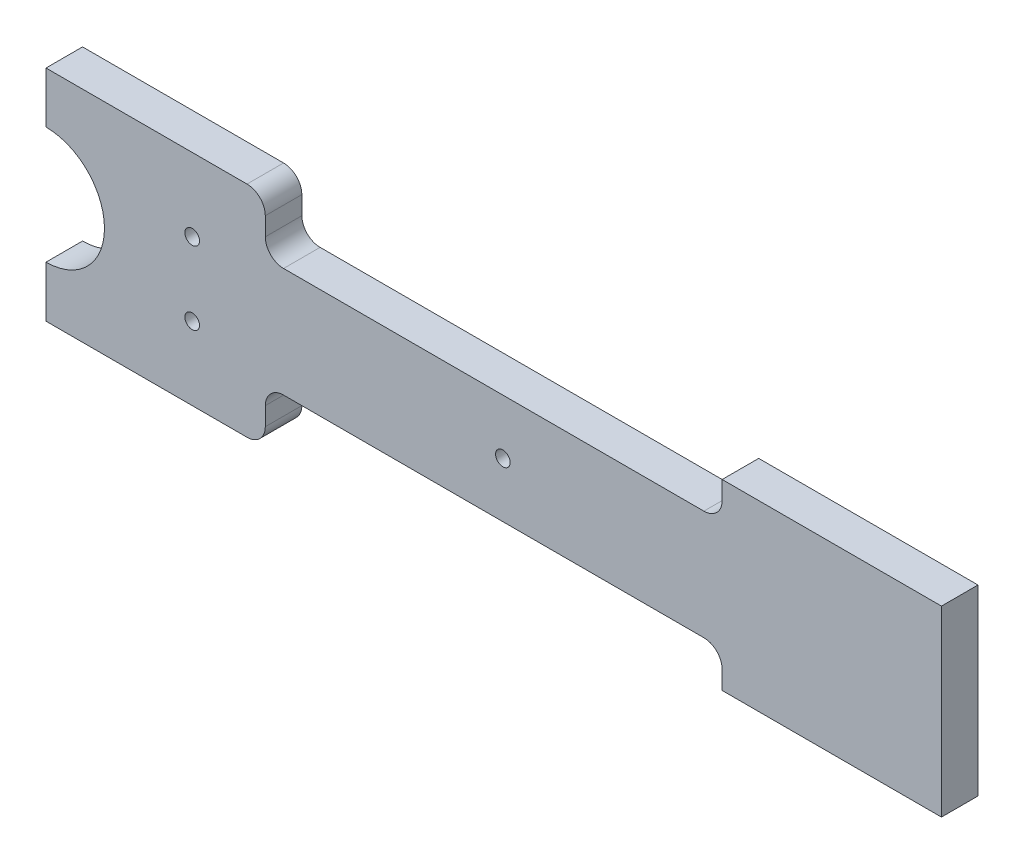
ISO-10303-21;
HEADER;
FILE_DESCRIPTION(('STEP AP214'),'2;1');
FILE_NAME('part.step','',(''),(''),'','','');
FILE_SCHEMA(('AUTOMOTIVE_DESIGN { 1 0 10303 214 1 1 1 1 }'));
ENDSEC;
DATA;
#1=APPLICATION_CONTEXT('core data for automotive mechanical design processes');
#2=APPLICATION_PROTOCOL_DEFINITION('international standard','automotive_design',2000,#1);
#3=PRODUCT_CONTEXT('',#1,'mechanical');
#4=PRODUCT('Part','Part','',(#3));
#5=PRODUCT_RELATED_PRODUCT_CATEGORY('part','',(#4));
#6=PRODUCT_DEFINITION_FORMATION('','',#4);
#7=PRODUCT_DEFINITION_CONTEXT('part definition',#1,'design');
#8=PRODUCT_DEFINITION('design','',#6,#7);
#9=PRODUCT_DEFINITION_SHAPE('','',#8);
#10=(LENGTH_UNIT() NAMED_UNIT(*) SI_UNIT(.MILLI.,.METRE.));
#11=(NAMED_UNIT(*) PLANE_ANGLE_UNIT() SI_UNIT($,.RADIAN.));
#12=(NAMED_UNIT(*) SI_UNIT($,.STERADIAN.) SOLID_ANGLE_UNIT());
#13=UNCERTAINTY_MEASURE_WITH_UNIT(LENGTH_MEASURE(1.E-05),#10,'distance_accuracy_value','');
#14=(GEOMETRIC_REPRESENTATION_CONTEXT(3) GLOBAL_UNCERTAINTY_ASSIGNED_CONTEXT((#13)) GLOBAL_UNIT_ASSIGNED_CONTEXT((#10,
#11,#12)) REPRESENTATION_CONTEXT('',''));
#15=CARTESIAN_POINT('',(0.,0.,0.));
#16=DIRECTION('',(0.,0.,1.));
#17=DIRECTION('',(1.,0.,0.));
#18=AXIS2_PLACEMENT_3D('',#15,#16,#17);
#19=CARTESIAN_POINT('',(185.,55.,10.));
#20=DIRECTION('',(0.,-1.,0.));
#21=DIRECTION('',(1.,0.,0.));
#22=AXIS2_PLACEMENT_3D('',#19,#20,#21);
#23=PLANE('',#22);
#24=DIRECTION('',(-1.,0.,0.));
#25=VECTOR('',#24,1.);
#26=CARTESIAN_POINT('',(185.,55.,0.));
#27=LINE('',#26,#25);
#28=CARTESIAN_POINT('',(245.,55.,0.));
#29=VERTEX_POINT('',#28);
#30=CARTESIAN_POINT('',(185.,55.,0.));
#31=VERTEX_POINT('',#30);
#32=EDGE_CURVE('E211',#29,#31,#27,.T.);
#33=ORIENTED_EDGE('',*,*,#32,.T.);
#34=DIRECTION('',(0.,0.,-1.));
#35=VECTOR('',#34,1.);
#36=CARTESIAN_POINT('',(185.,55.,10.));
#37=LINE('',#36,#35);
#38=CARTESIAN_POINT('',(185.,55.,10.));
#39=VERTEX_POINT('',#38);
#40=EDGE_CURVE('E250',#39,#31,#37,.T.);
#41=ORIENTED_EDGE('',*,*,#40,.F.);
#42=DIRECTION('',(-1.,0.,0.));
#43=VECTOR('',#42,1.);
#44=CARTESIAN_POINT('',(185.,55.,10.));
#45=LINE('',#44,#43);
#46=CARTESIAN_POINT('',(245.,55.,10.));
#47=VERTEX_POINT('',#46);
#48=EDGE_CURVE('E241',#47,#39,#45,.T.);
#49=ORIENTED_EDGE('',*,*,#48,.F.);
#50=DIRECTION('',(0.,0.,-1.));
#51=VECTOR('',#50,1.);
#52=CARTESIAN_POINT('',(245.,55.,10.));
#53=LINE('',#52,#51);
#54=EDGE_CURVE('E210',#47,#29,#53,.T.);
#55=ORIENTED_EDGE('',*,*,#54,.T.);
#56=EDGE_LOOP('',(#33,#41,#49,#55));
#57=FACE_BOUND('',#56,.T.);
#58=ADVANCED_FACE('F33',(#57),#23,.F.);
#59=CARTESIAN_POINT('',(185.,45.,10.));
#60=DIRECTION('',(1.,0.,0.));
#61=DIRECTION('',(0.,0.,-1.));
#62=AXIS2_PLACEMENT_3D('',#59,#60,#61);
#63=PLANE('',#62);
#64=DIRECTION('',(0.,-1.,0.));
#65=VECTOR('',#64,1.);
#66=CARTESIAN_POINT('',(185.,45.,0.));
#67=LINE('',#66,#65);
#68=CARTESIAN_POINT('',(185.,50.,0.));
#69=VERTEX_POINT('',#68);
#70=EDGE_CURVE('E214',#31,#69,#67,.T.);
#71=ORIENTED_EDGE('',*,*,#70,.T.);
#72=DIRECTION('',(0.,0.,-1.));
#73=VECTOR('',#72,1.);
#74=CARTESIAN_POINT('',(185.,50.,10.));
#75=LINE('',#74,#73);
#76=CARTESIAN_POINT('',(185.,50.,10.));
#77=VERTEX_POINT('',#76);
#78=EDGE_CURVE('E266',#69,#77,#75,.F.);
#79=ORIENTED_EDGE('',*,*,#78,.T.);
#80=DIRECTION('',(0.,-1.,0.));
#81=VECTOR('',#80,1.);
#82=CARTESIAN_POINT('',(185.,45.,10.));
#83=LINE('',#82,#81);
#84=EDGE_CURVE('E340',#39,#77,#83,.T.);
#85=ORIENTED_EDGE('',*,*,#84,.F.);
#86=ORIENTED_EDGE('',*,*,#40,.T.);
#87=EDGE_LOOP('',(#71,#79,#85,#86));
#88=FACE_BOUND('',#87,.T.);
#89=ADVANCED_FACE('F375',(#88),#63,.F.);
#90=CARTESIAN_POINT('',(60.,45.,10.));
#91=DIRECTION('',(0.,-1.,0.));
#92=DIRECTION('',(1.,0.,0.));
#93=AXIS2_PLACEMENT_3D('',#90,#91,#92);
#94=PLANE('',#93);
#95=DIRECTION('',(-1.,0.,0.));
#96=VECTOR('',#95,1.);
#97=CARTESIAN_POINT('',(60.,45.,10.));
#98=LINE('',#97,#96);
#99=CARTESIAN_POINT('',(180.,45.,10.));
#100=VERTEX_POINT('',#99);
#101=CARTESIAN_POINT('',(65.,45.,10.));
#102=VERTEX_POINT('',#101);
#103=EDGE_CURVE('E343',#100,#102,#98,.T.);
#104=ORIENTED_EDGE('',*,*,#103,.F.);
#105=DIRECTION('',(0.,0.,-1.));
#106=VECTOR('',#105,1.);
#107=CARTESIAN_POINT('',(180.,45.,0.));
#108=LINE('',#107,#106);
#109=CARTESIAN_POINT('',(180.,45.,0.));
#110=VERTEX_POINT('',#109);
#111=EDGE_CURVE('E263',#100,#110,#108,.T.);
#112=ORIENTED_EDGE('',*,*,#111,.T.);
#113=DIRECTION('',(-1.,0.,0.));
#114=VECTOR('',#113,1.);
#115=CARTESIAN_POINT('',(60.,45.,0.));
#116=LINE('',#115,#114);
#117=CARTESIAN_POINT('',(65.,45.,0.));
#118=VERTEX_POINT('',#117);
#119=EDGE_CURVE('E218',#110,#118,#116,.T.);
#120=ORIENTED_EDGE('',*,*,#119,.T.);
#121=DIRECTION('',(0.,0.,-1.));
#122=VECTOR('',#121,1.);
#123=CARTESIAN_POINT('',(65.,45.,10.));
#124=LINE('',#123,#122);
#125=EDGE_CURVE('E261',#118,#102,#124,.F.);
#126=ORIENTED_EDGE('',*,*,#125,.T.);
#127=EDGE_LOOP('',(#104,#112,#120,#126));
#128=FACE_BOUND('',#127,.T.);
#129=ADVANCED_FACE('F367',(#128),#94,.F.);
#130=CARTESIAN_POINT('',(60.,60.,10.));
#131=DIRECTION('',(-1.,0.,0.));
#132=DIRECTION('',(0.,0.,1.));
#133=AXIS2_PLACEMENT_3D('',#130,#131,#132);
#134=PLANE('',#133);
#135=DIRECTION('',(0.,1.,0.));
#136=VECTOR('',#135,1.);
#137=CARTESIAN_POINT('',(60.,60.,10.));
#138=LINE('',#137,#136);
#139=CARTESIAN_POINT('',(60.,50.,10.));
#140=VERTEX_POINT('',#139);
#141=CARTESIAN_POINT('',(60.,55.,10.));
#142=VERTEX_POINT('',#141);
#143=EDGE_CURVE('E198',#140,#142,#138,.T.);
#144=ORIENTED_EDGE('',*,*,#143,.F.);
#145=DIRECTION('',(0.,0.,-1.));
#146=VECTOR('',#145,1.);
#147=CARTESIAN_POINT('',(60.,50.,0.));
#148=LINE('',#147,#146);
#149=CARTESIAN_POINT('',(60.,50.,0.));
#150=VERTEX_POINT('',#149);
#151=EDGE_CURVE('E283',#140,#150,#148,.T.);
#152=ORIENTED_EDGE('',*,*,#151,.T.);
#153=DIRECTION('',(0.,1.,0.));
#154=VECTOR('',#153,1.);
#155=CARTESIAN_POINT('',(60.,60.,0.));
#156=LINE('',#155,#154);
#157=CARTESIAN_POINT('',(60.,55.,0.));
#158=VERTEX_POINT('',#157);
#159=EDGE_CURVE('E221',#150,#158,#156,.T.);
#160=ORIENTED_EDGE('',*,*,#159,.T.);
#161=DIRECTION('',(0.,0.,-1.));
#162=VECTOR('',#161,1.);
#163=CARTESIAN_POINT('',(60.,55.,10.));
#164=LINE('',#163,#162);
#165=EDGE_CURVE('E281',#158,#142,#164,.F.);
#166=ORIENTED_EDGE('',*,*,#165,.T.);
#167=EDGE_LOOP('',(#144,#152,#160,#166));
#168=FACE_BOUND('',#167,.T.);
#169=ADVANCED_FACE('F360',(#168),#134,.F.);
#170=CARTESIAN_POINT('',(-60.,60.,10.));
#171=DIRECTION('',(0.,-1.,0.));
#172=DIRECTION('',(0.,0.,-1.));
#173=AXIS2_PLACEMENT_3D('',#170,#171,#172);
#174=PLANE('',#173);
#175=DIRECTION('',(-1.,0.,0.));
#176=VECTOR('',#175,1.);
#177=CARTESIAN_POINT('',(-60.,60.,0.));
#178=LINE('',#177,#176);
#179=CARTESIAN_POINT('',(55.,60.,0.));
#180=VERTEX_POINT('',#179);
#181=CARTESIAN_POINT('',(0.,60.,0.));
#182=VERTEX_POINT('',#181);
#183=EDGE_CURVE('E224',#180,#182,#178,.T.);
#184=ORIENTED_EDGE('',*,*,#183,.T.);
#185=DIRECTION('',(0.,0.,1.));
#186=VECTOR('',#185,1.);
#187=CARTESIAN_POINT('',(0.,60.,10.));
#188=LINE('',#187,#186);
#189=CARTESIAN_POINT('',(0.,60.,10.));
#190=VERTEX_POINT('',#189);
#191=EDGE_CURVE('E314',#182,#190,#188,.T.);
#192=ORIENTED_EDGE('',*,*,#191,.T.);
#193=DIRECTION('',(-1.,0.,0.));
#194=VECTOR('',#193,1.);
#195=CARTESIAN_POINT('',(-60.,60.,10.));
#196=LINE('',#195,#194);
#197=CARTESIAN_POINT('',(55.,60.,10.));
#198=VERTEX_POINT('',#197);
#199=EDGE_CURVE('E192',#198,#190,#196,.T.);
#200=ORIENTED_EDGE('',*,*,#199,.F.);
#201=DIRECTION('',(0.,0.,-1.));
#202=VECTOR('',#201,1.);
#203=CARTESIAN_POINT('',(55.,60.,10.));
#204=LINE('',#203,#202);
#205=EDGE_CURVE('E273',#198,#180,#204,.T.);
#206=ORIENTED_EDGE('',*,*,#205,.T.);
#207=EDGE_LOOP('',(#184,#192,#200,#206));
#208=FACE_BOUND('',#207,.T.);
#209=ADVANCED_FACE('F358',(#208),#174,.F.);
#210=CARTESIAN_POINT('',(-60.,0.,10.));
#211=DIRECTION('',(0.,1.,0.));
#212=DIRECTION('',(0.,0.,1.));
#213=AXIS2_PLACEMENT_3D('',#210,#211,#212);
#214=PLANE('',#213);
#215=DIRECTION('',(1.,0.,0.));
#216=VECTOR('',#215,1.);
#217=CARTESIAN_POINT('',(-60.,0.,10.));
#218=LINE('',#217,#216);
#219=CARTESIAN_POINT('',(0.,0.,10.));
#220=VERTEX_POINT('',#219);
#221=CARTESIAN_POINT('',(55.,0.,10.));
#222=VERTEX_POINT('',#221);
#223=EDGE_CURVE('E180',#220,#222,#218,.T.);
#224=ORIENTED_EDGE('',*,*,#223,.F.);
#225=DIRECTION('',(0.,0.,-1.));
#226=VECTOR('',#225,1.);
#227=CARTESIAN_POINT('',(0.,0.,10.));
#228=LINE('',#227,#226);
#229=CARTESIAN_POINT('',(0.,0.,0.));
#230=VERTEX_POINT('',#229);
#231=EDGE_CURVE('E167',#220,#230,#228,.T.);
#232=ORIENTED_EDGE('',*,*,#231,.T.);
#233=DIRECTION('',(1.,0.,0.));
#234=VECTOR('',#233,1.);
#235=CARTESIAN_POINT('',(-60.,0.,0.));
#236=LINE('',#235,#234);
#237=CARTESIAN_POINT('',(55.,0.,0.));
#238=VERTEX_POINT('',#237);
#239=EDGE_CURVE('E227',#230,#238,#236,.T.);
#240=ORIENTED_EDGE('',*,*,#239,.T.);
#241=DIRECTION('',(0.,0.,-1.));
#242=VECTOR('',#241,1.);
#243=CARTESIAN_POINT('',(55.,0.,10.));
#244=LINE('',#243,#242);
#245=EDGE_CURVE('E189',#238,#222,#244,.F.);
#246=ORIENTED_EDGE('',*,*,#245,.T.);
#247=EDGE_LOOP('',(#224,#232,#240,#246));
#248=FACE_BOUND('',#247,.T.);
#249=ADVANCED_FACE('F187',(#248),#214,.F.);
#250=CARTESIAN_POINT('',(60.,0.,10.));
#251=DIRECTION('',(-1.,0.,0.));
#252=DIRECTION('',(0.,0.,1.));
#253=AXIS2_PLACEMENT_3D('',#250,#251,#252);
#254=PLANE('',#253);
#255=DIRECTION('',(0.,1.,0.));
#256=VECTOR('',#255,1.);
#257=CARTESIAN_POINT('',(60.,0.,0.));
#258=LINE('',#257,#256);
#259=CARTESIAN_POINT('',(60.,5.,0.));
#260=VERTEX_POINT('',#259);
#261=CARTESIAN_POINT('',(60.,10.,0.));
#262=VERTEX_POINT('',#261);
#263=EDGE_CURVE('E229',#260,#262,#258,.T.);
#264=ORIENTED_EDGE('',*,*,#263,.T.);
#265=DIRECTION('',(0.,0.,-1.));
#266=VECTOR('',#265,1.);
#267=CARTESIAN_POINT('',(60.,10.,10.));
#268=LINE('',#267,#266);
#269=CARTESIAN_POINT('',(60.,10.,10.));
#270=VERTEX_POINT('',#269);
#271=EDGE_CURVE('E289',#262,#270,#268,.F.);
#272=ORIENTED_EDGE('',*,*,#271,.T.);
#273=DIRECTION('',(0.,1.,0.));
#274=VECTOR('',#273,1.);
#275=CARTESIAN_POINT('',(60.,0.,10.));
#276=LINE('',#275,#274);
#277=CARTESIAN_POINT('',(60.,5.,10.));
#278=VERTEX_POINT('',#277);
#279=EDGE_CURVE('E191',#278,#270,#276,.T.);
#280=ORIENTED_EDGE('',*,*,#279,.F.);
#281=DIRECTION('',(0.,0.,-1.));
#282=VECTOR('',#281,1.);
#283=CARTESIAN_POINT('',(60.,5.,10.));
#284=LINE('',#283,#282);
#285=EDGE_CURVE('E286',#278,#260,#284,.T.);
#286=ORIENTED_EDGE('',*,*,#285,.T.);
#287=EDGE_LOOP('',(#264,#272,#280,#286));
#288=FACE_BOUND('',#287,.T.);
#289=ADVANCED_FACE('F410',(#288),#254,.F.);
#290=CARTESIAN_POINT('',(60.,15.,10.));
#291=DIRECTION('',(0.,1.,0.));
#292=DIRECTION('',(-1.,0.,0.));
#293=AXIS2_PLACEMENT_3D('',#290,#291,#292);
#294=PLANE('',#293);
#295=DIRECTION('',(1.,0.,0.));
#296=VECTOR('',#295,1.);
#297=CARTESIAN_POINT('',(60.,15.,0.));
#298=LINE('',#297,#296);
#299=CARTESIAN_POINT('',(65.,15.,0.));
#300=VERTEX_POINT('',#299);
#301=CARTESIAN_POINT('',(180.,15.,0.));
#302=VERTEX_POINT('',#301);
#303=EDGE_CURVE('E232',#300,#302,#298,.T.);
#304=ORIENTED_EDGE('',*,*,#303,.T.);
#305=DIRECTION('',(0.,0.,-1.));
#306=VECTOR('',#305,1.);
#307=CARTESIAN_POINT('',(180.,15.,10.));
#308=LINE('',#307,#306);
#309=CARTESIAN_POINT('',(180.,15.,10.));
#310=VERTEX_POINT('',#309);
#311=EDGE_CURVE('E259',#302,#310,#308,.F.);
#312=ORIENTED_EDGE('',*,*,#311,.T.);
#313=DIRECTION('',(1.,0.,0.));
#314=VECTOR('',#313,1.);
#315=CARTESIAN_POINT('',(60.,15.,10.));
#316=LINE('',#315,#314);
#317=CARTESIAN_POINT('',(65.,15.,10.));
#318=VERTEX_POINT('',#317);
#319=EDGE_CURVE('E195',#318,#310,#316,.T.);
#320=ORIENTED_EDGE('',*,*,#319,.F.);
#321=DIRECTION('',(0.,0.,-1.));
#322=VECTOR('',#321,1.);
#323=CARTESIAN_POINT('',(65.,15.,0.));
#324=LINE('',#323,#322);
#325=EDGE_CURVE('E256',#318,#300,#324,.T.);
#326=ORIENTED_EDGE('',*,*,#325,.T.);
#327=EDGE_LOOP('',(#304,#312,#320,#326));
#328=FACE_BOUND('',#327,.T.);
#329=ADVANCED_FACE('F399',(#328),#294,.F.);
#330=CARTESIAN_POINT('',(185.,15.,10.));
#331=DIRECTION('',(1.,0.,0.));
#332=DIRECTION('',(0.,0.,-1.));
#333=AXIS2_PLACEMENT_3D('',#330,#331,#332);
#334=PLANE('',#333);
#335=DIRECTION('',(0.,-1.,0.));
#336=VECTOR('',#335,1.);
#337=CARTESIAN_POINT('',(185.,15.,10.));
#338=LINE('',#337,#336);
#339=CARTESIAN_POINT('',(185.,10.,10.));
#340=VERTEX_POINT('',#339);
#341=CARTESIAN_POINT('',(185.,4.99999999999999,10.));
#342=VERTEX_POINT('',#341);
#343=EDGE_CURVE('E204',#340,#342,#338,.T.);
#344=ORIENTED_EDGE('',*,*,#343,.F.);
#345=DIRECTION('',(0.,0.,-1.));
#346=VECTOR('',#345,1.);
#347=CARTESIAN_POINT('',(185.,10.,0.));
#348=LINE('',#347,#346);
#349=CARTESIAN_POINT('',(185.,10.,0.));
#350=VERTEX_POINT('',#349);
#351=EDGE_CURVE('E253',#340,#350,#348,.T.);
#352=ORIENTED_EDGE('',*,*,#351,.T.);
#353=DIRECTION('',(0.,-1.,0.));
#354=VECTOR('',#353,1.);
#355=CARTESIAN_POINT('',(185.,15.,0.));
#356=LINE('',#355,#354);
#357=CARTESIAN_POINT('',(185.,4.99999999999999,0.));
#358=VERTEX_POINT('',#357);
#359=EDGE_CURVE('E235',#350,#358,#356,.T.);
#360=ORIENTED_EDGE('',*,*,#359,.T.);
#361=DIRECTION('',(0.,0.,-1.));
#362=VECTOR('',#361,1.);
#363=CARTESIAN_POINT('',(185.,4.99999999999999,10.));
#364=LINE('',#363,#362);
#365=EDGE_CURVE('E247',#342,#358,#364,.T.);
#366=ORIENTED_EDGE('',*,*,#365,.F.);
#367=EDGE_LOOP('',(#344,#352,#360,#366));
#368=FACE_BOUND('',#367,.T.);
#369=ADVANCED_FACE('F393',(#368),#334,.F.);
#370=CARTESIAN_POINT('',(185.,4.99999999999999,10.));
#371=DIRECTION('',(0.,1.,0.));
#372=DIRECTION('',(-1.,0.,0.));
#373=AXIS2_PLACEMENT_3D('',#370,#371,#372);
#374=PLANE('',#373);
#375=DIRECTION('',(1.,0.,0.));
#376=VECTOR('',#375,1.);
#377=CARTESIAN_POINT('',(185.,4.99999999999999,0.));
#378=LINE('',#377,#376);
#379=CARTESIAN_POINT('',(245.,4.99999999999999,0.));
#380=VERTEX_POINT('',#379);
#381=EDGE_CURVE('E237',#358,#380,#378,.T.);
#382=ORIENTED_EDGE('',*,*,#381,.T.);
#383=DIRECTION('',(0.,0.,-1.));
#384=VECTOR('',#383,1.);
#385=CARTESIAN_POINT('',(245.,4.99999999999999,10.));
#386=LINE('',#385,#384);
#387=CARTESIAN_POINT('',(245.,4.99999999999999,10.));
#388=VERTEX_POINT('',#387);
#389=EDGE_CURVE('E244',#388,#380,#386,.T.);
#390=ORIENTED_EDGE('',*,*,#389,.F.);
#391=DIRECTION('',(1.,0.,0.));
#392=VECTOR('',#391,1.);
#393=CARTESIAN_POINT('',(185.,4.99999999999999,10.));
#394=LINE('',#393,#392);
#395=EDGE_CURVE('E206',#342,#388,#394,.T.);
#396=ORIENTED_EDGE('',*,*,#395,.F.);
#397=ORIENTED_EDGE('',*,*,#365,.T.);
#398=EDGE_LOOP('',(#382,#390,#396,#397));
#399=FACE_BOUND('',#398,.T.);
#400=ADVANCED_FACE('F389',(#399),#374,.F.);
#401=CARTESIAN_POINT('',(245.,4.99999999999999,10.));
#402=DIRECTION('',(-1.,0.,0.));
#403=DIRECTION('',(0.,0.,1.));
#404=AXIS2_PLACEMENT_3D('',#401,#402,#403);
#405=PLANE('',#404);
#406=DIRECTION('',(0.,1.,0.));
#407=VECTOR('',#406,1.);
#408=CARTESIAN_POINT('',(245.,4.99999999999999,0.));
#409=LINE('',#408,#407);
#410=EDGE_CURVE('E239',#380,#29,#409,.T.);
#411=ORIENTED_EDGE('',*,*,#410,.T.);
#412=ORIENTED_EDGE('',*,*,#54,.F.);
#413=DIRECTION('',(0.,1.,0.));
#414=VECTOR('',#413,1.);
#415=CARTESIAN_POINT('',(245.,4.99999999999999,10.));
#416=LINE('',#415,#414);
#417=EDGE_CURVE('E208',#388,#47,#416,.T.);
#418=ORIENTED_EDGE('',*,*,#417,.F.);
#419=ORIENTED_EDGE('',*,*,#389,.T.);
#420=EDGE_LOOP('',(#411,#412,#418,#419));
#421=FACE_BOUND('',#420,.T.);
#422=ADVANCED_FACE('F384',(#421),#405,.F.);
#423=CARTESIAN_POINT('',(0.,0.,10.));
#424=DIRECTION('',(0.,0.,1.));
#425=DIRECTION('',(1.,0.,0.));
#426=AXIS2_PLACEMENT_3D('',#423,#424,#425);
#427=PLANE('',#426);
#428=DIRECTION('',(0.,-1.,0.));
#429=VECTOR('',#428,1.);
#430=CARTESIAN_POINT('',(0.,60.,10.));
#431=LINE('',#430,#429);
#432=CARTESIAN_POINT('',(0.,14.,10.));
#433=VERTEX_POINT('',#432);
#434=EDGE_CURVE('E48',#433,#220,#431,.T.);
#435=ORIENTED_EDGE('',*,*,#434,.T.);
#436=ORIENTED_EDGE('',*,*,#223,.T.);
#437=CARTESIAN_POINT('',(55.,5.,10.));
#438=DIRECTION('',(0.,0.,1.));
#439=DIRECTION('',(1.,0.,0.));
#440=AXIS2_PLACEMENT_3D('',#437,#438,#439);
#441=CIRCLE('',#440,5.);
#442=EDGE_CURVE('E276',#222,#278,#441,.T.);
#443=ORIENTED_EDGE('',*,*,#442,.T.);
#444=ORIENTED_EDGE('',*,*,#279,.T.);
#445=CARTESIAN_POINT('',(65.,10.,10.));
#446=DIRECTION('',(0.,0.,1.));
#447=DIRECTION('',(1.,0.,0.));
#448=AXIS2_PLACEMENT_3D('',#445,#446,#447);
#449=CIRCLE('',#448,5.);
#450=EDGE_CURVE('E305',#270,#318,#449,.F.);
#451=ORIENTED_EDGE('',*,*,#450,.T.);
#452=ORIENTED_EDGE('',*,*,#319,.T.);
#453=CARTESIAN_POINT('',(180.,10.,10.));
#454=DIRECTION('',(0.,0.,1.));
#455=DIRECTION('',(1.,0.,0.));
#456=AXIS2_PLACEMENT_3D('',#453,#454,#455);
#457=CIRCLE('',#456,5.);
#458=EDGE_CURVE('E293',#310,#340,#457,.F.);
#459=ORIENTED_EDGE('',*,*,#458,.T.);
#460=ORIENTED_EDGE('',*,*,#343,.T.);
#461=ORIENTED_EDGE('',*,*,#395,.T.);
#462=ORIENTED_EDGE('',*,*,#417,.T.);
#463=ORIENTED_EDGE('',*,*,#48,.T.);
#464=ORIENTED_EDGE('',*,*,#84,.T.);
#465=CARTESIAN_POINT('',(180.,50.,10.));
#466=DIRECTION('',(0.,0.,1.));
#467=DIRECTION('',(1.,0.,0.));
#468=AXIS2_PLACEMENT_3D('',#465,#466,#467);
#469=CIRCLE('',#468,5.);
#470=EDGE_CURVE('E297',#77,#100,#469,.F.);
#471=ORIENTED_EDGE('',*,*,#470,.T.);
#472=ORIENTED_EDGE('',*,*,#103,.T.);
#473=CARTESIAN_POINT('',(65.,50.,10.));
#474=DIRECTION('',(0.,0.,1.));
#475=DIRECTION('',(1.,0.,0.));
#476=AXIS2_PLACEMENT_3D('',#473,#474,#475);
#477=CIRCLE('',#476,5.);
#478=EDGE_CURVE('E301',#102,#140,#477,.F.);
#479=ORIENTED_EDGE('',*,*,#478,.T.);
#480=ORIENTED_EDGE('',*,*,#143,.T.);
#481=CARTESIAN_POINT('',(55.,55.,10.));
#482=DIRECTION('',(0.,0.,1.));
#483=DIRECTION('',(1.,0.,0.));
#484=AXIS2_PLACEMENT_3D('',#481,#482,#483);
#485=CIRCLE('',#484,5.);
#486=EDGE_CURVE('E278',#142,#198,#485,.T.);
#487=ORIENTED_EDGE('',*,*,#486,.T.);
#488=ORIENTED_EDGE('',*,*,#199,.T.);
#489=CARTESIAN_POINT('',(0.,46.,10.));
#490=VERTEX_POINT('',#489);
#491=EDGE_CURVE('E174',#190,#490,#431,.T.);
#492=ORIENTED_EDGE('',*,*,#491,.T.);
#493=CARTESIAN_POINT('',(0.,30.,10.));
#494=DIRECTION('',(0.,0.,1.));
#495=DIRECTION('',(1.,0.,0.));
#496=AXIS2_PLACEMENT_3D('',#493,#494,#495);
#497=CIRCLE('',#496,16.);
#498=EDGE_CURVE('E184',#433,#490,#497,.T.);
#499=ORIENTED_EDGE('',*,*,#498,.F.);
#500=EDGE_LOOP('',(#435,#436,#443,#444,#451,#452,#459,#460,#461,#462,#463,#464,#471,#472,#479,
#480,#487,#488,#492,#499));
#501=FACE_BOUND('',#500,.T.);
#502=CARTESIAN_POINT('',(125.,30.,10.));
#503=DIRECTION('',(0.,0.,1.));
#504=DIRECTION('',(-1.,0.,0.));
#505=AXIS2_PLACEMENT_3D('',#502,#503,#504);
#506=CIRCLE('',#505,2.);
#507=CARTESIAN_POINT('',(123.,30.,10.));
#508=VERTEX_POINT('',#507);
#509=EDGE_CURVE('E317',#508,#508,#506,.T.);
#510=ORIENTED_EDGE('',*,*,#509,.F.);
#511=EDGE_LOOP('',(#510));
#512=FACE_BOUND('',#511,.T.);
#513=CARTESIAN_POINT('',(40.,40.,10.));
#514=DIRECTION('',(0.,0.,1.));
#515=DIRECTION('',(1.,0.,0.));
#516=AXIS2_PLACEMENT_3D('',#513,#514,#515);
#517=CIRCLE('',#516,2.);
#518=CARTESIAN_POINT('',(42.,40.,10.));
#519=VERTEX_POINT('',#518);
#520=EDGE_CURVE('E326',#519,#519,#517,.T.);
#521=ORIENTED_EDGE('',*,*,#520,.F.);
#522=EDGE_LOOP('',(#521));
#523=FACE_BOUND('',#522,.T.);
#524=CARTESIAN_POINT('',(40.,20.,10.));
#525=DIRECTION('',(0.,0.,1.));
#526=DIRECTION('',(-1.,0.,0.));
#527=AXIS2_PLACEMENT_3D('',#524,#525,#526);
#528=CIRCLE('',#527,2.);
#529=CARTESIAN_POINT('',(38.,20.,10.));
#530=VERTEX_POINT('',#529);
#531=EDGE_CURVE('E331',#530,#530,#528,.T.);
#532=ORIENTED_EDGE('',*,*,#531,.F.);
#533=EDGE_LOOP('',(#532));
#534=FACE_BOUND('',#533,.T.);
#535=ADVANCED_FACE('F178',(#501,#512,#523,#534),#427,.T.);
#536=CARTESIAN_POINT('',(0.,0.,0.));
#537=DIRECTION('',(0.,0.,1.));
#538=DIRECTION('',(1.,0.,0.));
#539=AXIS2_PLACEMENT_3D('',#536,#537,#538);
#540=PLANE('',#539);
#541=CARTESIAN_POINT('',(125.,30.,0.));
#542=DIRECTION('',(0.,0.,1.));
#543=DIRECTION('',(-1.,0.,0.));
#544=AXIS2_PLACEMENT_3D('',#541,#542,#543);
#545=CIRCLE('',#544,2.);
#546=CARTESIAN_POINT('',(123.,30.,0.));
#547=VERTEX_POINT('',#546);
#548=EDGE_CURVE('E320',#547,#547,#545,.T.);
#549=ORIENTED_EDGE('',*,*,#548,.T.);
#550=EDGE_LOOP('',(#549));
#551=FACE_BOUND('',#550,.T.);
#552=ORIENTED_EDGE('',*,*,#239,.F.);
#553=DIRECTION('',(0.,1.,0.));
#554=VECTOR('',#553,1.);
#555=CARTESIAN_POINT('',(0.,60.,0.));
#556=LINE('',#555,#554);
#557=CARTESIAN_POINT('',(0.,14.,0.));
#558=VERTEX_POINT('',#557);
#559=EDGE_CURVE('E170',#230,#558,#556,.T.);
#560=ORIENTED_EDGE('',*,*,#559,.T.);
#561=CARTESIAN_POINT('',(0.,30.,0.));
#562=DIRECTION('',(0.,0.,1.));
#563=DIRECTION('',(1.,0.,0.));
#564=AXIS2_PLACEMENT_3D('',#561,#562,#563);
#565=CIRCLE('',#564,16.);
#566=CARTESIAN_POINT('',(0.,46.,0.));
#567=VERTEX_POINT('',#566);
#568=EDGE_CURVE('E310',#558,#567,#565,.T.);
#569=ORIENTED_EDGE('',*,*,#568,.T.);
#570=EDGE_CURVE('E56',#567,#182,#556,.T.);
#571=ORIENTED_EDGE('',*,*,#570,.T.);
#572=ORIENTED_EDGE('',*,*,#183,.F.);
#573=CARTESIAN_POINT('',(55.,55.,0.));
#574=DIRECTION('',(0.,0.,1.));
#575=DIRECTION('',(1.,0.,0.));
#576=AXIS2_PLACEMENT_3D('',#573,#574,#575);
#577=CIRCLE('',#576,5.);
#578=EDGE_CURVE('E271',#180,#158,#577,.F.);
#579=ORIENTED_EDGE('',*,*,#578,.T.);
#580=ORIENTED_EDGE('',*,*,#159,.F.);
#581=CARTESIAN_POINT('',(65.,50.,0.));
#582=DIRECTION('',(0.,0.,1.));
#583=DIRECTION('',(1.,0.,0.));
#584=AXIS2_PLACEMENT_3D('',#581,#582,#583);
#585=CIRCLE('',#584,5.);
#586=EDGE_CURVE('E299',#150,#118,#585,.T.);
#587=ORIENTED_EDGE('',*,*,#586,.T.);
#588=ORIENTED_EDGE('',*,*,#119,.F.);
#589=CARTESIAN_POINT('',(180.,50.,0.));
#590=DIRECTION('',(0.,0.,1.));
#591=DIRECTION('',(1.,0.,0.));
#592=AXIS2_PLACEMENT_3D('',#589,#590,#591);
#593=CIRCLE('',#592,5.);
#594=EDGE_CURVE('E295',#110,#69,#593,.T.);
#595=ORIENTED_EDGE('',*,*,#594,.T.);
#596=ORIENTED_EDGE('',*,*,#70,.F.);
#597=ORIENTED_EDGE('',*,*,#32,.F.);
#598=ORIENTED_EDGE('',*,*,#410,.F.);
#599=ORIENTED_EDGE('',*,*,#381,.F.);
#600=ORIENTED_EDGE('',*,*,#359,.F.);
#601=CARTESIAN_POINT('',(180.,10.,0.));
#602=DIRECTION('',(0.,0.,1.));
#603=DIRECTION('',(1.,0.,0.));
#604=AXIS2_PLACEMENT_3D('',#601,#602,#603);
#605=CIRCLE('',#604,5.);
#606=EDGE_CURVE('E291',#350,#302,#605,.T.);
#607=ORIENTED_EDGE('',*,*,#606,.T.);
#608=ORIENTED_EDGE('',*,*,#303,.F.);
#609=CARTESIAN_POINT('',(65.,10.,0.));
#610=DIRECTION('',(0.,0.,1.));
#611=DIRECTION('',(1.,0.,0.));
#612=AXIS2_PLACEMENT_3D('',#609,#610,#611);
#613=CIRCLE('',#612,5.);
#614=EDGE_CURVE('E303',#300,#262,#613,.T.);
#615=ORIENTED_EDGE('',*,*,#614,.T.);
#616=ORIENTED_EDGE('',*,*,#263,.F.);
#617=CARTESIAN_POINT('',(55.,5.,0.));
#618=DIRECTION('',(0.,0.,1.));
#619=DIRECTION('',(1.,0.,0.));
#620=AXIS2_PLACEMENT_3D('',#617,#618,#619);
#621=CIRCLE('',#620,5.);
#622=EDGE_CURVE('E268',#260,#238,#621,.F.);
#623=ORIENTED_EDGE('',*,*,#622,.T.);
#624=EDGE_LOOP('',(#552,#560,#569,#571,#572,#579,#580,#587,#588,#595,#596,#597,#598,#599,#600,
#607,#608,#615,#616,#623));
#625=FACE_BOUND('',#624,.T.);
#626=CARTESIAN_POINT('',(40.,40.,0.));
#627=DIRECTION('',(0.,0.,1.));
#628=DIRECTION('',(1.,0.,0.));
#629=AXIS2_PLACEMENT_3D('',#626,#627,#628);
#630=CIRCLE('',#629,2.);
#631=CARTESIAN_POINT('',(42.,40.,0.));
#632=VERTEX_POINT('',#631);
#633=EDGE_CURVE('E328',#632,#632,#630,.T.);
#634=ORIENTED_EDGE('',*,*,#633,.T.);
#635=EDGE_LOOP('',(#634));
#636=FACE_BOUND('',#635,.T.);
#637=CARTESIAN_POINT('',(40.,20.,0.));
#638=DIRECTION('',(0.,0.,1.));
#639=DIRECTION('',(-1.,0.,0.));
#640=AXIS2_PLACEMENT_3D('',#637,#638,#639);
#641=CIRCLE('',#640,2.);
#642=CARTESIAN_POINT('',(38.,20.,0.));
#643=VERTEX_POINT('',#642);
#644=EDGE_CURVE('E215',#643,#643,#641,.T.);
#645=ORIENTED_EDGE('',*,*,#644,.T.);
#646=EDGE_LOOP('',(#645));
#647=FACE_BOUND('',#646,.T.);
#648=ADVANCED_FACE('F312',(#551,#625,#636,#647),#540,.F.);
#649=CARTESIAN_POINT('',(40.,20.,0.));
#650=DIRECTION('',(0.,0.,1.));
#651=DIRECTION('',(1.,0.,0.));
#652=AXIS2_PLACEMENT_3D('',#649,#650,#651);
#653=CYLINDRICAL_SURFACE('',#652,2.);
#654=ORIENTED_EDGE('',*,*,#644,.F.);
#655=EDGE_LOOP('',(#654));
#656=FACE_BOUND('',#655,.T.);
#657=ORIENTED_EDGE('',*,*,#531,.T.);
#658=EDGE_LOOP('',(#657));
#659=FACE_BOUND('',#658,.T.);
#660=ADVANCED_FACE('F496',(#656,#659),#653,.F.);
#661=CARTESIAN_POINT('',(40.,40.,0.));
#662=DIRECTION('',(0.,0.,1.));
#663=DIRECTION('',(1.,0.,0.));
#664=AXIS2_PLACEMENT_3D('',#661,#662,#663);
#665=CYLINDRICAL_SURFACE('',#664,2.);
#666=ORIENTED_EDGE('',*,*,#633,.F.);
#667=EDGE_LOOP('',(#666));
#668=FACE_BOUND('',#667,.T.);
#669=ORIENTED_EDGE('',*,*,#520,.T.);
#670=EDGE_LOOP('',(#669));
#671=FACE_BOUND('',#670,.T.);
#672=ADVANCED_FACE('F508',(#668,#671),#665,.F.);
#673=CARTESIAN_POINT('',(0.,30.,0.));
#674=DIRECTION('',(0.,0.,1.));
#675=DIRECTION('',(1.,0.,0.));
#676=AXIS2_PLACEMENT_3D('',#673,#674,#675);
#677=CYLINDRICAL_SURFACE('',#676,16.);
#678=ORIENTED_EDGE('',*,*,#498,.T.);
#679=DIRECTION('',(0.,0.,1.));
#680=VECTOR('',#679,1.);
#681=CARTESIAN_POINT('',(0.,46.,0.));
#682=LINE('',#681,#680);
#683=EDGE_CURVE('E11',#490,#567,#682,.F.);
#684=ORIENTED_EDGE('',*,*,#683,.T.);
#685=ORIENTED_EDGE('',*,*,#568,.F.);
#686=DIRECTION('',(0.,0.,1.));
#687=VECTOR('',#686,1.);
#688=CARTESIAN_POINT('',(0.,14.,0.));
#689=LINE('',#688,#687);
#690=EDGE_CURVE('E41',#558,#433,#689,.T.);
#691=ORIENTED_EDGE('',*,*,#690,.T.);
#692=EDGE_LOOP('',(#678,#684,#685,#691));
#693=FACE_BOUND('',#692,.T.);
#694=ADVANCED_FACE('F308',(#693),#677,.F.);
#695=CARTESIAN_POINT('',(180.,10.,10.));
#696=DIRECTION('',(0.,0.,1.));
#697=DIRECTION('',(1.,0.,0.));
#698=AXIS2_PLACEMENT_3D('',#695,#696,#697);
#699=CYLINDRICAL_SURFACE('',#698,5.);
#700=ORIENTED_EDGE('',*,*,#458,.F.);
#701=ORIENTED_EDGE('',*,*,#311,.F.);
#702=ORIENTED_EDGE('',*,*,#606,.F.);
#703=ORIENTED_EDGE('',*,*,#351,.F.);
#704=EDGE_LOOP('',(#700,#701,#702,#703));
#705=FACE_BOUND('',#704,.T.);
#706=ADVANCED_FACE('F403',(#705),#699,.F.);
#707=CARTESIAN_POINT('',(180.,50.,10.));
#708=DIRECTION('',(0.,0.,1.));
#709=DIRECTION('',(1.,0.,0.));
#710=AXIS2_PLACEMENT_3D('',#707,#708,#709);
#711=CYLINDRICAL_SURFACE('',#710,5.);
#712=ORIENTED_EDGE('',*,*,#470,.F.);
#713=ORIENTED_EDGE('',*,*,#78,.F.);
#714=ORIENTED_EDGE('',*,*,#594,.F.);
#715=ORIENTED_EDGE('',*,*,#111,.F.);
#716=EDGE_LOOP('',(#712,#713,#714,#715));
#717=FACE_BOUND('',#716,.T.);
#718=ADVANCED_FACE('F371',(#717),#711,.F.);
#719=CARTESIAN_POINT('',(65.,50.,10.));
#720=DIRECTION('',(0.,0.,1.));
#721=DIRECTION('',(1.,0.,0.));
#722=AXIS2_PLACEMENT_3D('',#719,#720,#721);
#723=CYLINDRICAL_SURFACE('',#722,5.);
#724=ORIENTED_EDGE('',*,*,#478,.F.);
#725=ORIENTED_EDGE('',*,*,#125,.F.);
#726=ORIENTED_EDGE('',*,*,#586,.F.);
#727=ORIENTED_EDGE('',*,*,#151,.F.);
#728=EDGE_LOOP('',(#724,#725,#726,#727));
#729=FACE_BOUND('',#728,.T.);
#730=ADVANCED_FACE('F362',(#729),#723,.F.);
#731=CARTESIAN_POINT('',(55.,55.,10.));
#732=DIRECTION('',(0.,0.,-1.));
#733=DIRECTION('',(-1.,0.,0.));
#734=AXIS2_PLACEMENT_3D('',#731,#732,#733);
#735=CYLINDRICAL_SURFACE('',#734,5.);
#736=ORIENTED_EDGE('',*,*,#486,.F.);
#737=ORIENTED_EDGE('',*,*,#165,.F.);
#738=ORIENTED_EDGE('',*,*,#578,.F.);
#739=ORIENTED_EDGE('',*,*,#205,.F.);
#740=EDGE_LOOP('',(#736,#737,#738,#739));
#741=FACE_BOUND('',#740,.T.);
#742=ADVANCED_FACE('F355',(#741),#735,.T.);
#743=CARTESIAN_POINT('',(65.,10.,10.));
#744=DIRECTION('',(0.,0.,1.));
#745=DIRECTION('',(1.,0.,0.));
#746=AXIS2_PLACEMENT_3D('',#743,#744,#745);
#747=CYLINDRICAL_SURFACE('',#746,5.);
#748=ORIENTED_EDGE('',*,*,#450,.F.);
#749=ORIENTED_EDGE('',*,*,#271,.F.);
#750=ORIENTED_EDGE('',*,*,#614,.F.);
#751=ORIENTED_EDGE('',*,*,#325,.F.);
#752=EDGE_LOOP('',(#748,#749,#750,#751));
#753=FACE_BOUND('',#752,.T.);
#754=ADVANCED_FACE('F406',(#753),#747,.F.);
#755=CARTESIAN_POINT('',(55.,5.,10.));
#756=DIRECTION('',(0.,0.,-1.));
#757=DIRECTION('',(-1.,0.,0.));
#758=AXIS2_PLACEMENT_3D('',#755,#756,#757);
#759=CYLINDRICAL_SURFACE('',#758,5.);
#760=ORIENTED_EDGE('',*,*,#442,.F.);
#761=ORIENTED_EDGE('',*,*,#245,.F.);
#762=ORIENTED_EDGE('',*,*,#622,.F.);
#763=ORIENTED_EDGE('',*,*,#285,.F.);
#764=EDGE_LOOP('',(#760,#761,#762,#763));
#765=FACE_BOUND('',#764,.T.);
#766=ADVANCED_FACE('F35',(#765),#759,.T.);
#767=CARTESIAN_POINT('',(125.,30.,0.));
#768=DIRECTION('',(0.,0.,1.));
#769=DIRECTION('',(1.,0.,0.));
#770=AXIS2_PLACEMENT_3D('',#767,#768,#769);
#771=CYLINDRICAL_SURFACE('',#770,2.);
#772=ORIENTED_EDGE('',*,*,#548,.F.);
#773=EDGE_LOOP('',(#772));
#774=FACE_BOUND('',#773,.T.);
#775=ORIENTED_EDGE('',*,*,#509,.T.);
#776=EDGE_LOOP('',(#775));
#777=FACE_BOUND('',#776,.T.);
#778=ADVANCED_FACE('F415',(#774,#777),#771,.F.);
#779=CARTESIAN_POINT('',(0.,0.,0.));
#780=DIRECTION('',(1.,0.,0.));
#781=DIRECTION('',(0.,0.,-1.));
#782=AXIS2_PLACEMENT_3D('',#779,#780,#781);
#783=PLANE('',#782);
#784=CARTESIAN_POINT('',(0.,7.,5.));
#785=DIRECTION('',(-1.,0.,0.));
#786=DIRECTION('',(0.,0.,1.));
#787=AXIS2_PLACEMENT_3D('',#784,#785,#786);
#788=CIRCLE('',#787,2.);
#789=CARTESIAN_POINT('',(0.,7.,7.));
#790=VERTEX_POINT('',#789);
#791=EDGE_CURVE('E674',#790,#790,#788,.T.);
#792=ORIENTED_EDGE('',*,*,#791,.F.);
#793=EDGE_LOOP('',(#792));
#794=FACE_BOUND('',#793,.T.);
#795=ORIENTED_EDGE('',*,*,#559,.F.);
#796=ORIENTED_EDGE('',*,*,#231,.F.);
#797=ORIENTED_EDGE('',*,*,#434,.F.);
#798=ORIENTED_EDGE('',*,*,#690,.F.);
#799=EDGE_LOOP('',(#795,#796,#797,#798));
#800=FACE_BOUND('',#799,.T.);
#801=ADVANCED_FACE('F168',(#794,#800),#783,.F.);
#802=CARTESIAN_POINT('',(0.,53.,5.));
#803=DIRECTION('',(-1.,0.,0.));
#804=DIRECTION('',(0.,0.,1.));
#805=AXIS2_PLACEMENT_3D('',#802,#803,#804);
#806=CIRCLE('',#805,2.);
#807=CARTESIAN_POINT('',(0.,53.,7.00000000000001));
#808=VERTEX_POINT('',#807);
#809=EDGE_CURVE('E673',#808,#808,#806,.T.);
#810=ORIENTED_EDGE('',*,*,#809,.F.);
#811=EDGE_LOOP('',(#810));
#812=FACE_BOUND('',#811,.T.);
#813=ORIENTED_EDGE('',*,*,#491,.F.);
#814=ORIENTED_EDGE('',*,*,#191,.F.);
#815=ORIENTED_EDGE('',*,*,#570,.F.);
#816=ORIENTED_EDGE('',*,*,#683,.F.);
#817=EDGE_LOOP('',(#813,#814,#815,#816));
#818=FACE_BOUND('',#817,.T.);
#819=ADVANCED_FACE('F518',(#812,#818),#783,.F.);
#820=CARTESIAN_POINT('',(12.,53.,5.));
#821=DIRECTION('',(-1.,0.,0.));
#822=DIRECTION('',(0.,0.,1.));
#823=AXIS2_PLACEMENT_3D('',#820,#821,#822);
#824=CYLINDRICAL_SURFACE('',#823,2.);
#825=CARTESIAN_POINT('',(12.,53.,5.));
#826=DIRECTION('',(-1.,0.,0.));
#827=DIRECTION('',(0.,0.,1.));
#828=AXIS2_PLACEMENT_3D('',#825,#826,#827);
#829=CIRCLE('',#828,2.);
#830=CARTESIAN_POINT('',(12.,53.,7.00000000000001));
#831=VERTEX_POINT('',#830);
#832=EDGE_CURVE('E185',#831,#831,#829,.T.);
#833=ORIENTED_EDGE('',*,*,#832,.F.);
#834=EDGE_LOOP('',(#833));
#835=FACE_BOUND('',#834,.T.);
#836=ORIENTED_EDGE('',*,*,#809,.T.);
#837=EDGE_LOOP('',(#836));
#838=FACE_BOUND('',#837,.T.);
#839=ADVANCED_FACE('F528',(#835,#838),#824,.F.);
#840=CARTESIAN_POINT('',(12.,53.,5.));
#841=DIRECTION('',(-1.,0.,0.));
#842=DIRECTION('',(0.,0.,1.));
#843=AXIS2_PLACEMENT_3D('',#840,#841,#842);
#844=PLANE('',#843);
#845=ORIENTED_EDGE('',*,*,#832,.T.);
#846=EDGE_LOOP('',(#845));
#847=FACE_BOUND('',#846,.T.);
#848=ADVANCED_FACE('F537',(#847),#844,.T.);
#849=CARTESIAN_POINT('',(12.,7.,5.));
#850=DIRECTION('',(-1.,0.,0.));
#851=DIRECTION('',(0.,0.,1.));
#852=AXIS2_PLACEMENT_3D('',#849,#850,#851);
#853=CYLINDRICAL_SURFACE('',#852,2.);
#854=CARTESIAN_POINT('',(12.,7.,5.));
#855=DIRECTION('',(-1.,0.,0.));
#856=DIRECTION('',(0.,0.,1.));
#857=AXIS2_PLACEMENT_3D('',#854,#855,#856);
#858=CIRCLE('',#857,2.);
#859=CARTESIAN_POINT('',(12.,7.,7.));
#860=VERTEX_POINT('',#859);
#861=EDGE_CURVE('E672',#860,#860,#858,.T.);
#862=ORIENTED_EDGE('',*,*,#861,.F.);
#863=EDGE_LOOP('',(#862));
#864=FACE_BOUND('',#863,.T.);
#865=ORIENTED_EDGE('',*,*,#791,.T.);
#866=EDGE_LOOP('',(#865));
#867=FACE_BOUND('',#866,.T.);
#868=ADVANCED_FACE('F547',(#864,#867),#853,.F.);
#869=CARTESIAN_POINT('',(12.,7.,5.));
#870=DIRECTION('',(-1.,0.,0.));
#871=DIRECTION('',(0.,0.,1.));
#872=AXIS2_PLACEMENT_3D('',#869,#870,#871);
#873=PLANE('',#872);
#874=ORIENTED_EDGE('',*,*,#861,.T.);
#875=EDGE_LOOP('',(#874));
#876=FACE_BOUND('',#875,.T.);
#877=ADVANCED_FACE('F557',(#876),#873,.T.);
#878=CLOSED_SHELL('',(#58,#89,#129,#169,#209,#249,#289,#329,#369,#400,#422,#535,#648,#660,#672,
#694,#706,#718,#730,#742,#754,#766,#778,#801,#819,#839,#848,#868,#877));
#879=MANIFOLD_SOLID_BREP('B2',#878);
#880=ADVANCED_BREP_SHAPE_REPRESENTATION('',(#18,#879),#14);
#881=SHAPE_DEFINITION_REPRESENTATION(#9,#880);
ENDSEC;
END-ISO-10303-21;
